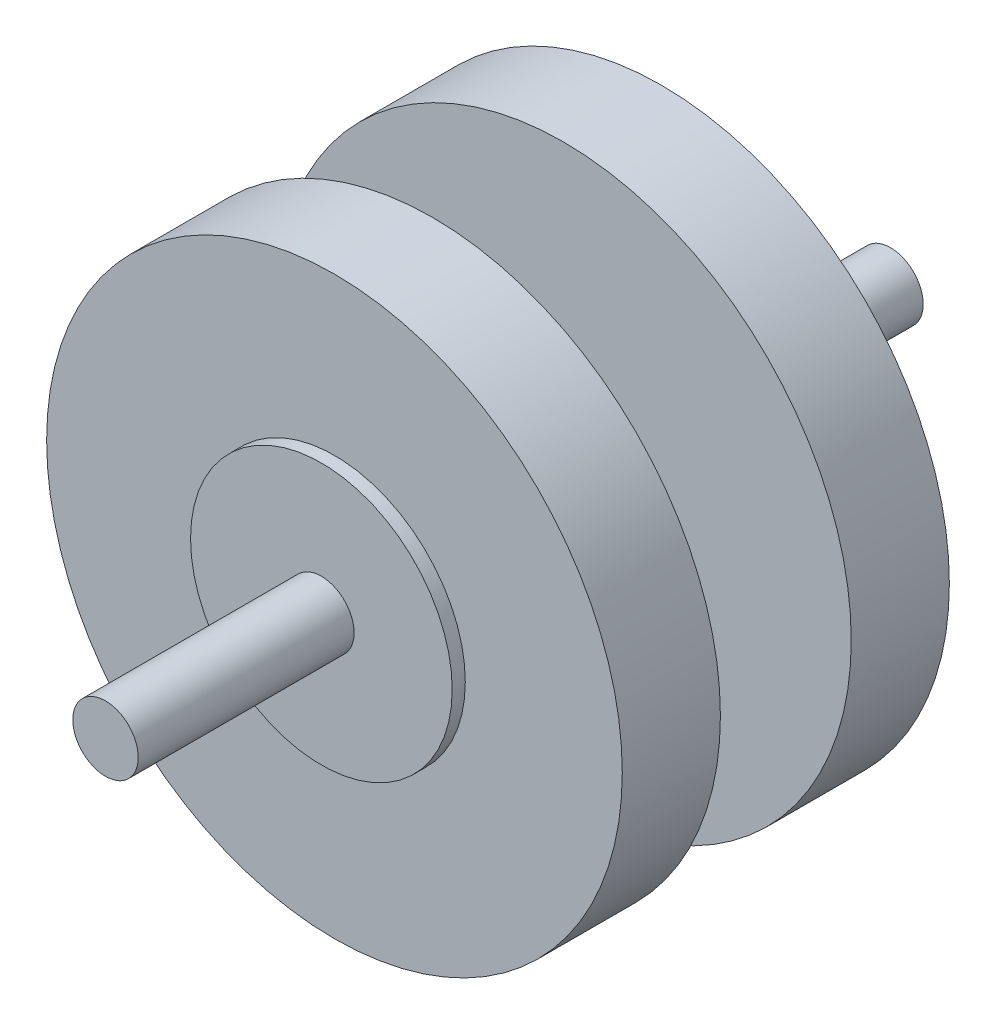
ISO-10303-21;
HEADER;
FILE_DESCRIPTION(('STEP AP214'),'2;1');
FILE_NAME('part.step','',(''),(''),'','','');
FILE_SCHEMA(('AUTOMOTIVE_DESIGN { 1 0 10303 214 1 1 1 1 }'));
ENDSEC;
DATA;
#1=APPLICATION_CONTEXT('core data for automotive mechanical design processes');
#2=APPLICATION_PROTOCOL_DEFINITION('international standard','automotive_design',2000,#1);
#3=PRODUCT_CONTEXT('',#1,'mechanical');
#4=PRODUCT('Part','Part','',(#3));
#5=PRODUCT_RELATED_PRODUCT_CATEGORY('part','',(#4));
#6=PRODUCT_DEFINITION_FORMATION('','',#4);
#7=PRODUCT_DEFINITION_CONTEXT('part definition',#1,'design');
#8=PRODUCT_DEFINITION('design','',#6,#7);
#9=PRODUCT_DEFINITION_SHAPE('','',#8);
#10=(LENGTH_UNIT() NAMED_UNIT(*) SI_UNIT(.MILLI.,.METRE.));
#11=(NAMED_UNIT(*) PLANE_ANGLE_UNIT() SI_UNIT($,.RADIAN.));
#12=(NAMED_UNIT(*) SI_UNIT($,.STERADIAN.) SOLID_ANGLE_UNIT());
#13=UNCERTAINTY_MEASURE_WITH_UNIT(LENGTH_MEASURE(1.E-05),#10,'distance_accuracy_value','');
#14=(GEOMETRIC_REPRESENTATION_CONTEXT(3) GLOBAL_UNCERTAINTY_ASSIGNED_CONTEXT((#13)) GLOBAL_UNIT_ASSIGNED_CONTEXT((#10,
#11,#12)) REPRESENTATION_CONTEXT('',''));
#15=CARTESIAN_POINT('',(0.,0.,0.));
#16=DIRECTION('',(0.,0.,1.));
#17=DIRECTION('',(1.,0.,0.));
#18=AXIS2_PLACEMENT_3D('',#15,#16,#17);
#19=CARTESIAN_POINT('',(0.,0.,-33.));
#20=DIRECTION('',(0.,0.,1.));
#21=DIRECTION('',(1.,0.,0.));
#22=AXIS2_PLACEMENT_3D('',#19,#20,#21);
#23=CYLINDRICAL_SURFACE('',#22,5.);
#24=CARTESIAN_POINT('',(0.,0.,-33.));
#25=DIRECTION('',(0.,0.,1.));
#26=DIRECTION('',(1.,0.,0.));
#27=AXIS2_PLACEMENT_3D('',#24,#25,#26);
#28=CIRCLE('',#27,5.);
#29=CARTESIAN_POINT('',(5.,0.,-33.));
#30=VERTEX_POINT('',#29);
#31=EDGE_CURVE('E72',#30,#30,#28,.T.);
#32=ORIENTED_EDGE('',*,*,#31,.T.);
#33=EDGE_LOOP('',(#32));
#34=FACE_BOUND('',#33,.T.);
#35=CARTESIAN_POINT('',(0.,0.,0.));
#36=DIRECTION('',(0.,0.,1.));
#37=DIRECTION('',(1.,0.,0.));
#38=AXIS2_PLACEMENT_3D('',#35,#36,#37);
#39=CIRCLE('',#38,5.);
#40=CARTESIAN_POINT('',(5.,0.,0.));
#41=VERTEX_POINT('',#40);
#42=EDGE_CURVE('E34',#41,#41,#39,.T.);
#43=ORIENTED_EDGE('',*,*,#42,.F.);
#44=EDGE_LOOP('',(#43));
#45=FACE_BOUND('',#44,.T.);
#46=ADVANCED_FACE('F31',(#34,#45),#23,.T.);
#47=CARTESIAN_POINT('',(0.,0.,0.));
#48=DIRECTION('',(0.,0.,1.));
#49=DIRECTION('',(1.,0.,0.));
#50=AXIS2_PLACEMENT_3D('',#47,#48,#49);
#51=PLANE('',#50);
#52=ORIENTED_EDGE('',*,*,#42,.T.);
#53=EDGE_LOOP('',(#52));
#54=FACE_BOUND('',#53,.T.);
#55=ADVANCED_FACE('F80',(#54),#51,.T.);
#56=CARTESIAN_POINT('',(0.,0.,-35.));
#57=DIRECTION('',(0.,0.,1.));
#58=DIRECTION('',(1.,0.,0.));
#59=AXIS2_PLACEMENT_3D('',#56,#57,#58);
#60=CYLINDRICAL_SURFACE('',#59,20.);
#61=CARTESIAN_POINT('',(0.,0.,-35.));
#62=DIRECTION('',(0.,0.,-1.));
#63=DIRECTION('',(-1.,0.,0.));
#64=AXIS2_PLACEMENT_3D('',#61,#62,#63);
#65=CIRCLE('',#64,20.);
#66=CARTESIAN_POINT('',(-20.,0.,-35.));
#67=VERTEX_POINT('',#66);
#68=EDGE_CURVE('E69',#67,#67,#65,.T.);
#69=ORIENTED_EDGE('',*,*,#68,.F.);
#70=EDGE_LOOP('',(#69));
#71=FACE_BOUND('',#70,.T.);
#72=CARTESIAN_POINT('',(0.,0.,-33.));
#73=DIRECTION('',(0.,0.,-1.));
#74=DIRECTION('',(-1.,0.,0.));
#75=AXIS2_PLACEMENT_3D('',#72,#73,#74);
#76=CIRCLE('',#75,20.);
#77=CARTESIAN_POINT('',(-20.,0.,-33.));
#78=VERTEX_POINT('',#77);
#79=EDGE_CURVE('E66',#78,#78,#76,.T.);
#80=ORIENTED_EDGE('',*,*,#79,.T.);
#81=EDGE_LOOP('',(#80));
#82=FACE_BOUND('',#81,.T.);
#83=ADVANCED_FACE('F86',(#71,#82),#60,.T.);
#84=CARTESIAN_POINT('',(0.,0.,-33.));
#85=DIRECTION('',(0.,0.,-1.));
#86=DIRECTION('',(-1.,0.,0.));
#87=AXIS2_PLACEMENT_3D('',#84,#85,#86);
#88=PLANE('',#87);
#89=ORIENTED_EDGE('',*,*,#31,.F.);
#90=EDGE_LOOP('',(#89));
#91=FACE_BOUND('',#90,.T.);
#92=ORIENTED_EDGE('',*,*,#79,.F.);
#93=EDGE_LOOP('',(#92));
#94=FACE_BOUND('',#93,.T.);
#95=ADVANCED_FACE('F90',(#91,#94),#88,.F.);
#96=CARTESIAN_POINT('',(0.,0.,-50.));
#97=DIRECTION('',(0.,0.,1.));
#98=DIRECTION('',(1.,0.,0.));
#99=AXIS2_PLACEMENT_3D('',#96,#97,#98);
#100=CYLINDRICAL_SURFACE('',#99,44.);
#101=CARTESIAN_POINT('',(0.,0.,-50.));
#102=DIRECTION('',(0.,0.,-1.));
#103=DIRECTION('',(-1.,0.,0.));
#104=AXIS2_PLACEMENT_3D('',#101,#102,#103);
#105=CIRCLE('',#104,44.);
#106=CARTESIAN_POINT('',(-44.,0.,-50.));
#107=VERTEX_POINT('',#106);
#108=EDGE_CURVE('E63',#107,#107,#105,.T.);
#109=ORIENTED_EDGE('',*,*,#108,.F.);
#110=EDGE_LOOP('',(#109));
#111=FACE_BOUND('',#110,.T.);
#112=CARTESIAN_POINT('',(0.,0.,-35.));
#113=DIRECTION('',(0.,0.,-1.));
#114=DIRECTION('',(-1.,0.,0.));
#115=AXIS2_PLACEMENT_3D('',#112,#113,#114);
#116=CIRCLE('',#115,44.);
#117=CARTESIAN_POINT('',(-44.,0.,-35.));
#118=VERTEX_POINT('',#117);
#119=EDGE_CURVE('E60',#118,#118,#116,.T.);
#120=ORIENTED_EDGE('',*,*,#119,.T.);
#121=EDGE_LOOP('',(#120));
#122=FACE_BOUND('',#121,.T.);
#123=ADVANCED_FACE('F96',(#111,#122),#100,.T.);
#124=CARTESIAN_POINT('',(0.,0.,-50.));
#125=DIRECTION('',(0.,0.,-1.));
#126=DIRECTION('',(-1.,0.,0.));
#127=AXIS2_PLACEMENT_3D('',#124,#125,#126);
#128=PLANE('',#127);
#129=CARTESIAN_POINT('',(-9.13498650340277,-17.7919088796667,-50.));
#130=DIRECTION('',(0.,0.,-1.));
#131=DIRECTION('',(-1.,0.,0.));
#132=AXIS2_PLACEMENT_3D('',#129,#130,#131);
#133=CIRCLE('',#132,5.);
#134=CARTESIAN_POINT('',(-14.1349865034028,-17.7919088796667,-50.));
#135=VERTEX_POINT('',#134);
#136=EDGE_CURVE('E54',#135,#135,#133,.T.);
#137=ORIENTED_EDGE('',*,*,#136,.F.);
#138=EDGE_LOOP('',(#137));
#139=FACE_BOUND('',#138,.T.);
#140=ORIENTED_EDGE('',*,*,#108,.T.);
#141=EDGE_LOOP('',(#140));
#142=FACE_BOUND('',#141,.T.);
#143=ADVANCED_FACE('F100',(#139,#142),#128,.T.);
#144=CARTESIAN_POINT('',(0.,0.,-35.));
#145=DIRECTION('',(0.,0.,-1.));
#146=DIRECTION('',(-1.,0.,0.));
#147=AXIS2_PLACEMENT_3D('',#144,#145,#146);
#148=PLANE('',#147);
#149=ORIENTED_EDGE('',*,*,#68,.T.);
#150=EDGE_LOOP('',(#149));
#151=FACE_BOUND('',#150,.T.);
#152=ORIENTED_EDGE('',*,*,#119,.F.);
#153=EDGE_LOOP('',(#152));
#154=FACE_BOUND('',#153,.T.);
#155=ADVANCED_FACE('F102',(#151,#154),#148,.F.);
#156=CARTESIAN_POINT('',(-9.13498650340277,-17.7919088796667,-70.));
#157=DIRECTION('',(0.,0.,1.));
#158=DIRECTION('',(1.,0.,0.));
#159=AXIS2_PLACEMENT_3D('',#156,#157,#158);
#160=CYLINDRICAL_SURFACE('',#159,5.);
#161=CARTESIAN_POINT('',(-9.13498650340277,-17.7919088796667,-70.));
#162=DIRECTION('',(0.,0.,-1.));
#163=DIRECTION('',(-1.,0.,0.));
#164=AXIS2_PLACEMENT_3D('',#161,#162,#163);
#165=CIRCLE('',#164,5.);
#166=CARTESIAN_POINT('',(-14.1349865034028,-17.7919088796667,-70.));
#167=VERTEX_POINT('',#166);
#168=EDGE_CURVE('E57',#167,#167,#165,.T.);
#169=ORIENTED_EDGE('',*,*,#168,.F.);
#170=EDGE_LOOP('',(#169));
#171=FACE_BOUND('',#170,.T.);
#172=ORIENTED_EDGE('',*,*,#136,.T.);
#173=EDGE_LOOP('',(#172));
#174=FACE_BOUND('',#173,.T.);
#175=ADVANCED_FACE('F105',(#171,#174),#160,.T.);
#176=CARTESIAN_POINT('',(0.,0.,-85.));
#177=DIRECTION('',(0.,0.,1.));
#178=DIRECTION('',(1.,0.,0.));
#179=AXIS2_PLACEMENT_3D('',#176,#177,#178);
#180=CYLINDRICAL_SURFACE('',#179,44.);
#181=CARTESIAN_POINT('',(0.,0.,-85.));
#182=DIRECTION('',(0.,0.,-1.));
#183=DIRECTION('',(-1.,0.,0.));
#184=AXIS2_PLACEMENT_3D('',#181,#182,#183);
#185=CIRCLE('',#184,44.);
#186=CARTESIAN_POINT('',(-44.,0.,-85.));
#187=VERTEX_POINT('',#186);
#188=EDGE_CURVE('E51',#187,#187,#185,.T.);
#189=ORIENTED_EDGE('',*,*,#188,.F.);
#190=EDGE_LOOP('',(#189));
#191=FACE_BOUND('',#190,.T.);
#192=CARTESIAN_POINT('',(0.,0.,-70.));
#193=DIRECTION('',(0.,0.,-1.));
#194=DIRECTION('',(-1.,0.,0.));
#195=AXIS2_PLACEMENT_3D('',#192,#193,#194);
#196=CIRCLE('',#195,44.);
#197=CARTESIAN_POINT('',(-44.,0.,-70.));
#198=VERTEX_POINT('',#197);
#199=EDGE_CURVE('E49',#198,#198,#196,.T.);
#200=ORIENTED_EDGE('',*,*,#199,.T.);
#201=EDGE_LOOP('',(#200));
#202=FACE_BOUND('',#201,.T.);
#203=ADVANCED_FACE('F112',(#191,#202),#180,.T.);
#204=CARTESIAN_POINT('',(0.,0.,-85.));
#205=DIRECTION('',(0.,0.,-1.));
#206=DIRECTION('',(-1.,0.,0.));
#207=AXIS2_PLACEMENT_3D('',#204,#205,#206);
#208=PLANE('',#207);
#209=CARTESIAN_POINT('',(0.,0.,-85.));
#210=DIRECTION('',(0.,0.,-1.));
#211=DIRECTION('',(-1.,0.,0.));
#212=AXIS2_PLACEMENT_3D('',#209,#210,#211);
#213=CIRCLE('',#212,20.);
#214=CARTESIAN_POINT('',(-20.,0.,-85.));
#215=VERTEX_POINT('',#214);
#216=EDGE_CURVE('E38',#215,#215,#213,.T.);
#217=ORIENTED_EDGE('',*,*,#216,.F.);
#218=EDGE_LOOP('',(#217));
#219=FACE_BOUND('',#218,.T.);
#220=ORIENTED_EDGE('',*,*,#188,.T.);
#221=EDGE_LOOP('',(#220));
#222=FACE_BOUND('',#221,.T.);
#223=ADVANCED_FACE('F116',(#219,#222),#208,.T.);
#224=CARTESIAN_POINT('',(0.,0.,-70.));
#225=DIRECTION('',(0.,0.,-1.));
#226=DIRECTION('',(-1.,0.,0.));
#227=AXIS2_PLACEMENT_3D('',#224,#225,#226);
#228=PLANE('',#227);
#229=ORIENTED_EDGE('',*,*,#168,.T.);
#230=EDGE_LOOP('',(#229));
#231=FACE_BOUND('',#230,.T.);
#232=ORIENTED_EDGE('',*,*,#199,.F.);
#233=EDGE_LOOP('',(#232));
#234=FACE_BOUND('',#233,.T.);
#235=ADVANCED_FACE('F118',(#231,#234),#228,.F.);
#236=CARTESIAN_POINT('',(0.,0.,-87.));
#237=DIRECTION('',(0.,0.,1.));
#238=DIRECTION('',(1.,0.,0.));
#239=AXIS2_PLACEMENT_3D('',#236,#237,#238);
#240=CYLINDRICAL_SURFACE('',#239,20.);
#241=CARTESIAN_POINT('',(0.,0.,-87.));
#242=DIRECTION('',(0.,0.,-1.));
#243=DIRECTION('',(-1.,0.,0.));
#244=AXIS2_PLACEMENT_3D('',#241,#242,#243);
#245=CIRCLE('',#244,20.);
#246=CARTESIAN_POINT('',(-20.,0.,-87.));
#247=VERTEX_POINT('',#246);
#248=EDGE_CURVE('E47',#247,#247,#245,.T.);
#249=ORIENTED_EDGE('',*,*,#248,.F.);
#250=EDGE_LOOP('',(#249));
#251=FACE_BOUND('',#250,.T.);
#252=ORIENTED_EDGE('',*,*,#216,.T.);
#253=EDGE_LOOP('',(#252));
#254=FACE_BOUND('',#253,.T.);
#255=ADVANCED_FACE('F121',(#251,#254),#240,.T.);
#256=CARTESIAN_POINT('',(0.,0.,-87.));
#257=DIRECTION('',(0.,0.,-1.));
#258=DIRECTION('',(-1.,0.,0.));
#259=AXIS2_PLACEMENT_3D('',#256,#257,#258);
#260=PLANE('',#259);
#261=CARTESIAN_POINT('',(0.,0.,-87.));
#262=DIRECTION('',(0.,0.,-1.));
#263=DIRECTION('',(-1.,0.,0.));
#264=AXIS2_PLACEMENT_3D('',#261,#262,#263);
#265=CIRCLE('',#264,5.);
#266=CARTESIAN_POINT('',(-5.,0.,-87.));
#267=VERTEX_POINT('',#266);
#268=EDGE_CURVE('E10',#267,#267,#265,.T.);
#269=ORIENTED_EDGE('',*,*,#268,.F.);
#270=EDGE_LOOP('',(#269));
#271=FACE_BOUND('',#270,.T.);
#272=ORIENTED_EDGE('',*,*,#248,.T.);
#273=EDGE_LOOP('',(#272));
#274=FACE_BOUND('',#273,.T.);
#275=ADVANCED_FACE('F128',(#271,#274),#260,.T.);
#276=CARTESIAN_POINT('',(0.,0.,-120.));
#277=DIRECTION('',(0.,0.,1.));
#278=DIRECTION('',(1.,0.,0.));
#279=AXIS2_PLACEMENT_3D('',#276,#277,#278);
#280=CYLINDRICAL_SURFACE('',#279,5.);
#281=CARTESIAN_POINT('',(0.,0.,-120.));
#282=DIRECTION('',(0.,0.,-1.));
#283=DIRECTION('',(-1.,0.,0.));
#284=AXIS2_PLACEMENT_3D('',#281,#282,#283);
#285=CIRCLE('',#284,5.);
#286=CARTESIAN_POINT('',(-5.,0.,-120.));
#287=VERTEX_POINT('',#286);
#288=EDGE_CURVE('E46',#287,#287,#285,.T.);
#289=ORIENTED_EDGE('',*,*,#288,.F.);
#290=EDGE_LOOP('',(#289));
#291=FACE_BOUND('',#290,.T.);
#292=ORIENTED_EDGE('',*,*,#268,.T.);
#293=EDGE_LOOP('',(#292));
#294=FACE_BOUND('',#293,.T.);
#295=ADVANCED_FACE('F132',(#291,#294),#280,.T.);
#296=CARTESIAN_POINT('',(0.,0.,-120.));
#297=DIRECTION('',(0.,0.,-1.));
#298=DIRECTION('',(-1.,0.,0.));
#299=AXIS2_PLACEMENT_3D('',#296,#297,#298);
#300=PLANE('',#299);
#301=ORIENTED_EDGE('',*,*,#288,.T.);
#302=EDGE_LOOP('',(#301));
#303=FACE_BOUND('',#302,.T.);
#304=ADVANCED_FACE('F136',(#303),#300,.T.);
#305=CLOSED_SHELL('',(#46,#55,#83,#95,#123,#143,#155,#175,#203,#223,#235,#255,#275,#295,#304));
#306=MANIFOLD_SOLID_BREP('B2',#305);
#307=ADVANCED_BREP_SHAPE_REPRESENTATION('',(#18,#306),#14);
#308=SHAPE_DEFINITION_REPRESENTATION(#9,#307);
ENDSEC;
END-ISO-10303-21;
